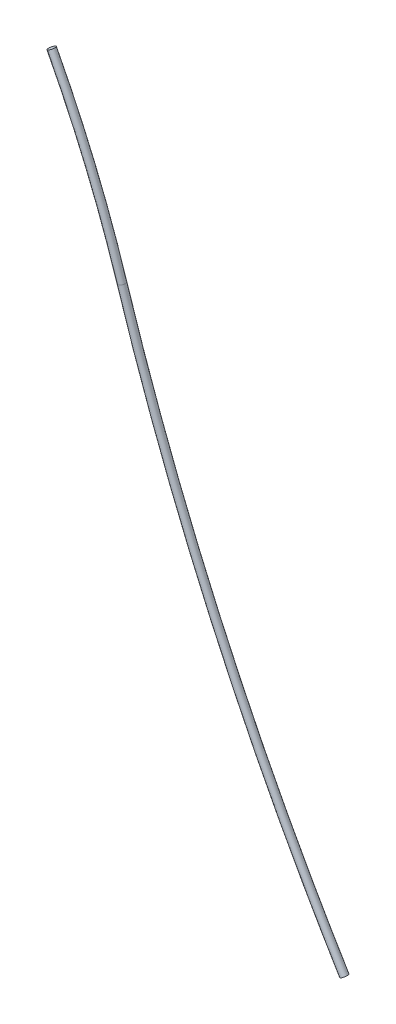
ISO-10303-21;
HEADER;
FILE_DESCRIPTION(('STEP AP214'),'2;1');
FILE_NAME('part.step','',(''),(''),'','','');
FILE_SCHEMA(('AUTOMOTIVE_DESIGN { 1 0 10303 214 1 1 1 1 }'));
ENDSEC;
DATA;
#1=APPLICATION_CONTEXT('core data for automotive mechanical design processes');
#2=APPLICATION_PROTOCOL_DEFINITION('international standard','automotive_design',2000,#1);
#3=PRODUCT_CONTEXT('',#1,'mechanical');
#4=PRODUCT('Part','Part','',(#3));
#5=PRODUCT_RELATED_PRODUCT_CATEGORY('part','',(#4));
#6=PRODUCT_DEFINITION_FORMATION('','',#4);
#7=PRODUCT_DEFINITION_CONTEXT('part definition',#1,'design');
#8=PRODUCT_DEFINITION('design','',#6,#7);
#9=PRODUCT_DEFINITION_SHAPE('','',#8);
#10=(LENGTH_UNIT() NAMED_UNIT(*) SI_UNIT(.MILLI.,.METRE.));
#11=(NAMED_UNIT(*) PLANE_ANGLE_UNIT() SI_UNIT($,.RADIAN.));
#12=(NAMED_UNIT(*) SI_UNIT($,.STERADIAN.) SOLID_ANGLE_UNIT());
#13=UNCERTAINTY_MEASURE_WITH_UNIT(LENGTH_MEASURE(1.E-05),#10,'distance_accuracy_value','');
#14=(GEOMETRIC_REPRESENTATION_CONTEXT(3) GLOBAL_UNCERTAINTY_ASSIGNED_CONTEXT((#13)) GLOBAL_UNIT_ASSIGNED_CONTEXT((#10,
#11,#12)) REPRESENTATION_CONTEXT('',''));
#15=CARTESIAN_POINT('',(0.,0.,0.));
#16=DIRECTION('',(0.,0.,1.));
#17=DIRECTION('',(1.,0.,0.));
#18=AXIS2_PLACEMENT_3D('',#15,#16,#17);
#19=CARTESIAN_POINT('',(-59.120554028104,114.273937690116,0.));
#20=DIRECTION('',(-0.464162196000011,0.885750222017724,0.));
#21=DIRECTION('',(-0.885750222017724,-0.464162196000011,0.));
#22=AXIS2_PLACEMENT_3D('',#19,#20,#21);
#23=PLANE('',#22);
#24=CARTESIAN_POINT('',(-59.120554028104,114.273937690116,0.));
#25=DIRECTION('',(-0.464162196000011,0.885750222017724,0.));
#26=DIRECTION('',(-0.885750222017724,-0.464162196000011,0.));
#27=AXIS2_PLACEMENT_3D('',#24,#25,#26);
#28=CIRCLE('',#27,0.999999999999998);
#29=CARTESIAN_POINT('',(-58.2348038060863,114.738099886116,0.));
#30=VERTEX_POINT('',#29);
#31=EDGE_CURVE('E65',#30,#30,#28,.T.);
#32=ORIENTED_EDGE('',*,*,#31,.T.);
#33=EDGE_LOOP('',(#32));
#34=FACE_BOUND('',#33,.T.);
#35=ADVANCED_FACE('F53',(#34),#23,.T.);
#36=CARTESIAN_POINT('',(23.9341937475576,-72.1709898443104,0.));
#37=DIRECTION('',(-0.518073568145654,0.855336061433651,0.));
#38=DIRECTION('',(-0.855336061433651,-0.518073568145654,0.));
#39=AXIS2_PLACEMENT_3D('',#36,#37,#38);
#40=PLANE('',#39);
#41=CARTESIAN_POINT('',(23.9341937475576,-72.1709898443104,0.));
#42=DIRECTION('',(-0.518073568145654,0.855336061433651,0.));
#43=DIRECTION('',(-0.855336061433651,-0.518073568145654,0.));
#44=AXIS2_PLACEMENT_3D('',#41,#42,#43);
#45=CIRCLE('',#44,0.999999999999998);
#46=CARTESIAN_POINT('',(23.0788576861239,-72.689063412456,0.));
#47=VERTEX_POINT('',#46);
#48=EDGE_CURVE('E11',#47,#47,#45,.T.);
#49=ORIENTED_EDGE('',*,*,#48,.F.);
#50=EDGE_LOOP('',(#49));
#51=FACE_BOUND('',#50,.T.);
#52=ADVANCED_FACE('F77',(#51),#40,.F.);
#53=CARTESIAN_POINT('',(-323.737434124781,-24.3939949969928,0.));
#54=DIRECTION('',(0.,0.,-1.));
#55=DIRECTION('',(-1.,0.,0.));
#56=AXIS2_PLACEMENT_3D('',#53,#54,#55);
#57=TOROIDAL_SURFACE('',#56,298.748872446099,0.999999999999998);
#58=CARTESIAN_POINT('',(-39.1605705841169,66.5284858599097,0.));
#59=DIRECTION('',(-0.304344180824672,0.952562134245404,0.));
#60=DIRECTION('',(-0.952562134245404,-0.304344180824672,0.));
#61=AXIS2_PLACEMENT_3D('',#58,#59,#60);
#62=CIRCLE('',#61,0.999999999999998);
#63=CARTESIAN_POINT('',(-38.2080084498714,66.8328300407344,0.));
#64=VERTEX_POINT('',#63);
#65=EDGE_CURVE('E60',#64,#64,#62,.T.);
#66=CARTESIAN_POINT('',(-323.737434124781,-24.3939949969928,0.));
#67=DIRECTION('',(0.,0.,-1.));
#68=DIRECTION('',(-1.,0.,0.));
#69=AXIS2_PLACEMENT_3D('',#66,#67,#68);
#70=CIRCLE('',#69,299.748872446099);
#71=EDGE_CURVE('',#30,#64,#70,.T.);
#72=ORIENTED_EDGE('',*,*,#31,.F.);
#73=ORIENTED_EDGE('',*,*,#65,.T.);
#74=ORIENTED_EDGE('',*,*,#71,.T.);
#75=ORIENTED_EDGE('',*,*,#71,.F.);
#76=EDGE_LOOP('',(#72,#74,#73,#75));
#77=FACE_BOUND('',#76,.T.);
#78=ADVANCED_FACE('F74',(#77),#57,.T.);
#79=CARTESIAN_POINT('',(579.003689612416,264.032342690878,0.));
#80=DIRECTION('',(0.,0.,1.));
#81=DIRECTION('',(1.,0.,0.));
#82=AXIS2_PLACEMENT_3D('',#79,#80,#81);
#83=TOROIDAL_SURFACE('',#82,648.949016523975,0.999999999999998);
#84=ORIENTED_EDGE('',*,*,#48,.T.);
#85=EDGE_LOOP('',(#84));
#86=FACE_BOUND('',#85,.T.);
#87=ORIENTED_EDGE('',*,*,#65,.F.);
#88=EDGE_LOOP('',(#87));
#89=FACE_BOUND('',#88,.T.);
#90=ADVANCED_FACE('F76',(#86,#89),#83,.T.);
#91=CLOSED_SHELL('',(#35,#52,#78,#90));
#92=MANIFOLD_SOLID_BREP('B2',#91);
#93=ADVANCED_BREP_SHAPE_REPRESENTATION('',(#18,#92),#14);
#94=SHAPE_DEFINITION_REPRESENTATION(#9,#93);
ENDSEC;
END-ISO-10303-21;
